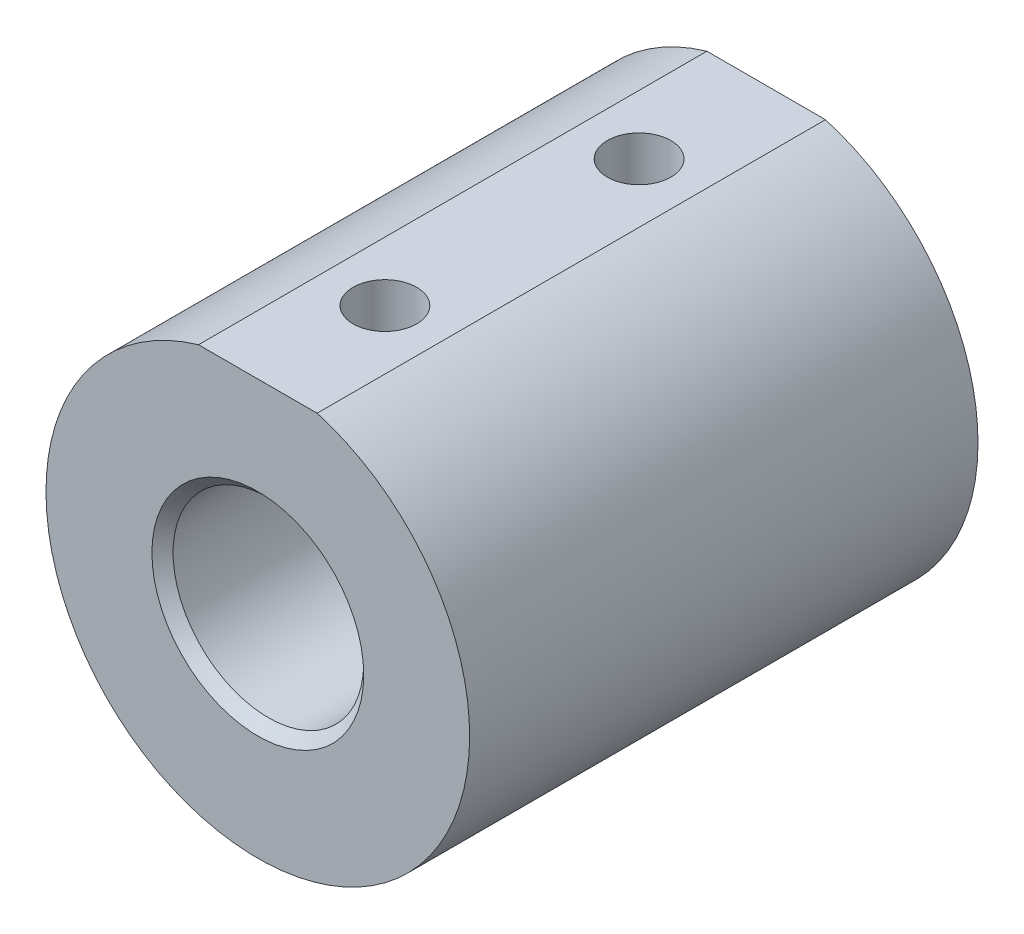
ISO-10303-21;
HEADER;
FILE_DESCRIPTION(('STEP AP214'),'2;1');
FILE_NAME('part.step','',(''),(''),'','','');
FILE_SCHEMA(('AUTOMOTIVE_DESIGN { 1 0 10303 214 1 1 1 1 }'));
ENDSEC;
DATA;
#1=APPLICATION_CONTEXT('core data for automotive mechanical design processes');
#2=APPLICATION_PROTOCOL_DEFINITION('international standard','automotive_design',2000,#1);
#3=PRODUCT_CONTEXT('',#1,'mechanical');
#4=PRODUCT('Part','Part','',(#3));
#5=PRODUCT_RELATED_PRODUCT_CATEGORY('part','',(#4));
#6=PRODUCT_DEFINITION_FORMATION('','',#4);
#7=PRODUCT_DEFINITION_CONTEXT('part definition',#1,'design');
#8=PRODUCT_DEFINITION('design','',#6,#7);
#9=PRODUCT_DEFINITION_SHAPE('','',#8);
#10=(LENGTH_UNIT() NAMED_UNIT(*) SI_UNIT(.MILLI.,.METRE.));
#11=(NAMED_UNIT(*) PLANE_ANGLE_UNIT() SI_UNIT($,.RADIAN.));
#12=(NAMED_UNIT(*) SI_UNIT($,.STERADIAN.) SOLID_ANGLE_UNIT());
#13=UNCERTAINTY_MEASURE_WITH_UNIT(LENGTH_MEASURE(1.E-05),#10,'distance_accuracy_value','');
#14=(GEOMETRIC_REPRESENTATION_CONTEXT(3) GLOBAL_UNCERTAINTY_ASSIGNED_CONTEXT((#13)) GLOBAL_UNIT_ASSIGNED_CONTEXT((#10,
#11,#12)) REPRESENTATION_CONTEXT('',''));
#15=CARTESIAN_POINT('',(0.,0.,0.));
#16=DIRECTION('',(0.,0.,1.));
#17=DIRECTION('',(1.,0.,0.));
#18=AXIS2_PLACEMENT_3D('',#15,#16,#17);
#19=CARTESIAN_POINT('',(0.,30.48,76.2));
#20=DIRECTION('',(0.,1.,0.));
#21=DIRECTION('',(0.,0.,1.));
#22=AXIS2_PLACEMENT_3D('',#19,#20,#21);
#23=PLANE('',#22);
#24=CARTESIAN_POINT('',(0.,30.48,57.15));
#25=DIRECTION('',(0.,1.,0.));
#26=DIRECTION('',(0.,0.,1.));
#27=AXIS2_PLACEMENT_3D('',#24,#25,#26);
#28=CIRCLE('',#27,4.76249999999999);
#29=CARTESIAN_POINT('',(0.,30.48,61.9125));
#30=VERTEX_POINT('',#29);
#31=EDGE_CURVE('E80',#30,#30,#28,.T.);
#32=ORIENTED_EDGE('',*,*,#31,.F.);
#33=EDGE_LOOP('',(#32));
#34=FACE_BOUND('',#33,.T.);
#35=CARTESIAN_POINT('',(0.,30.48,19.05));
#36=DIRECTION('',(0.,1.,0.));
#37=DIRECTION('',(0.,0.,1.));
#38=AXIS2_PLACEMENT_3D('',#35,#36,#37);
#39=CIRCLE('',#38,4.7625);
#40=CARTESIAN_POINT('',(0.,30.48,23.8125));
#41=VERTEX_POINT('',#40);
#42=EDGE_CURVE('E180',#41,#41,#39,.T.);
#43=ORIENTED_EDGE('',*,*,#42,.F.);
#44=EDGE_LOOP('',(#43));
#45=FACE_BOUND('',#44,.T.);
#46=DIRECTION('',(1.,0.,0.));
#47=VECTOR('',#46,1.);
#48=CARTESIAN_POINT('',(0.,30.48,0.));
#49=LINE('',#48,#47);
#50=CARTESIAN_POINT('',(-8.89,30.48,0.));
#51=VERTEX_POINT('',#50);
#52=CARTESIAN_POINT('',(8.89,30.48,0.));
#53=VERTEX_POINT('',#52);
#54=EDGE_CURVE('E72',#51,#53,#49,.T.);
#55=ORIENTED_EDGE('',*,*,#54,.F.);
#56=DIRECTION('',(0.,0.,-1.));
#57=VECTOR('',#56,1.);
#58=CARTESIAN_POINT('',(-8.89,30.48,76.2));
#59=LINE('',#58,#57);
#60=CARTESIAN_POINT('',(-8.89,30.48,76.2));
#61=VERTEX_POINT('',#60);
#62=EDGE_CURVE('E64',#61,#51,#59,.T.);
#63=ORIENTED_EDGE('',*,*,#62,.F.);
#64=DIRECTION('',(1.,0.,0.));
#65=VECTOR('',#64,1.);
#66=CARTESIAN_POINT('',(0.,30.48,76.2));
#67=LINE('',#66,#65);
#68=CARTESIAN_POINT('',(8.89,30.48,76.2));
#69=VERTEX_POINT('',#68);
#70=EDGE_CURVE('E73',#61,#69,#67,.T.);
#71=ORIENTED_EDGE('',*,*,#70,.T.);
#72=DIRECTION('',(0.,0.,-1.));
#73=VECTOR('',#72,1.);
#74=CARTESIAN_POINT('',(8.89,30.48,76.2));
#75=LINE('',#74,#73);
#76=EDGE_CURVE('E70',#69,#53,#75,.T.);
#77=ORIENTED_EDGE('',*,*,#76,.T.);
#78=EDGE_LOOP('',(#55,#63,#71,#77));
#79=FACE_BOUND('',#78,.T.);
#80=ADVANCED_FACE('F39',(#34,#45,#79),#23,.T.);
#81=CARTESIAN_POINT('',(0.,0.,76.2));
#82=DIRECTION('',(0.,0.,-1.));
#83=DIRECTION('',(-1.,0.,0.));
#84=AXIS2_PLACEMENT_3D('',#81,#82,#83);
#85=CYLINDRICAL_SURFACE('',#84,14.2875);
#86=CARTESIAN_POINT('',(0.,0.,1.58749999999998));
#87=DIRECTION('',(0.,0.,1.));
#88=DIRECTION('',(1.,0.,0.));
#89=AXIS2_PLACEMENT_3D('',#86,#87,#88);
#90=CIRCLE('',#89,14.2875);
#91=CARTESIAN_POINT('',(14.2875,0.,1.58749999999998));
#92=VERTEX_POINT('',#91);
#93=EDGE_CURVE('E49',#92,#92,#90,.F.);
#94=ORIENTED_EDGE('',*,*,#93,.T.);
#95=EDGE_LOOP('',(#94));
#96=FACE_BOUND('',#95,.T.);
#97=CARTESIAN_POINT('',(0.,0.,74.6124999999999));
#98=DIRECTION('',(0.,0.,1.));
#99=DIRECTION('',(1.,0.,0.));
#100=AXIS2_PLACEMENT_3D('',#97,#98,#99);
#101=CIRCLE('',#100,14.2875);
#102=CARTESIAN_POINT('',(14.2875,0.,74.6124999999999));
#103=VERTEX_POINT('',#102);
#104=EDGE_CURVE('E92',#103,#103,#101,.T.);
#105=ORIENTED_EDGE('',*,*,#104,.T.);
#106=EDGE_LOOP('',(#105));
#107=FACE_BOUND('',#106,.T.);
#108=CARTESIAN_POINT('',(0.,14.2875,61.9125));
#109=CARTESIAN_POINT('',(0.259858015748032,14.2875007287075,61.9125012083969));
#110=CARTESIAN_POINT('',(0.519708738989856,14.2803452727968,61.8911627325691));
#111=CARTESIAN_POINT('',(1.03175638615754,14.2525056359312,61.806633869258));
#112=CARTESIAN_POINT('',(1.28395251266588,14.2318200505025,61.7434391369433));
#113=CARTESIAN_POINT('',(1.77323491000222,14.1791677890443,61.5776046033835));
#114=CARTESIAN_POINT('',(2.01034567078225,14.1472199781818,61.4750307400377));
#115=CARTESIAN_POINT('',(2.46399813653537,14.0753042272884,61.2336476643574));
#116=CARTESIAN_POINT('',(2.68053577251585,14.0353347055531,61.0948313041751));
#117=CARTESIAN_POINT('',(3.09439472729355,13.950033747848,60.7798546043602));
#118=CARTESIAN_POINT('',(3.29090512267069,13.9045738765872,60.6026637468344));
#119=CARTESIAN_POINT('',(3.6520406989937,13.8141224915467,60.21815892571));
#120=CARTESIAN_POINT('',(3.81665885839365,13.7691310829646,60.0108383461531));
#121=CARTESIAN_POINT('',(4.11396628736011,13.6832974592279,59.5646583888767));
#122=CARTESIAN_POINT('',(4.2456013872774,13.6426117454961,59.3250635645252));
#123=CARTESIAN_POINT('',(4.46636238684293,13.5719489205694,58.8255613501417));
#124=CARTESIAN_POINT('',(4.55550125880551,13.5419685421874,58.5656601870145));
#125=CARTESIAN_POINT('',(4.6856973604364,13.4974633181733,58.04214378262));
#126=CARTESIAN_POINT('',(4.72827404739063,13.4824515609147,57.7789490445636));
#127=CARTESIAN_POINT('',(4.76888709988414,13.4681431470933,57.2487563708398));
#128=CARTESIAN_POINT('',(4.7669372289062,13.4688416343787,56.9817596358994));
#129=CARTESIAN_POINT('',(4.71973229137337,13.485448089363,56.4645017974729));
#130=CARTESIAN_POINT('',(4.67646026140595,13.5006595542244,56.214033480981));
#131=CARTESIAN_POINT('',(4.55107435051982,13.5434383226676,55.7241388390111));
#132=CARTESIAN_POINT('',(4.46895581913248,13.5710071055721,55.4847138393397));
#133=CARTESIAN_POINT('',(4.26690976402751,13.6358905180267,55.0191967801066));
#134=CARTESIAN_POINT('',(4.14639465697257,13.6733549460049,54.7933815287111));
#135=CARTESIAN_POINT('',(3.87138436876448,13.7537456020613,54.3645522993081));
#136=CARTESIAN_POINT('',(3.71687937263242,13.7966734062413,54.1615449329771));
#137=CARTESIAN_POINT('',(3.36875119690038,13.8858940516447,53.7729512637621));
#138=CARTESIAN_POINT('',(3.17350687723877,13.9322455680327,53.5888277924013));
#139=CARTESIAN_POINT('',(2.75434220198211,14.0211304406743,53.2555548425148));
#140=CARTESIAN_POINT('',(2.53041909933455,14.0636634304982,53.1064087182414));
#141=CARTESIAN_POINT('',(2.05715050713295,14.1406772655397,52.8461463701307));
#142=CARTESIAN_POINT('',(1.80757485393284,14.1750740441335,52.7354220974898));
#143=CARTESIAN_POINT('',(1.29191900952345,14.2313295102531,52.5579823840359));
#144=CARTESIAN_POINT('',(1.02584458671297,14.2531925528135,52.4912516557959));
#145=CARTESIAN_POINT('',(0.497127988133329,14.2811957392775,52.4062848905685));
#146=CARTESIAN_POINT('',(0.234836969356345,14.2879763373313,52.3860721588148));
#147=CARTESIAN_POINT('',(-0.289441270685619,14.2869714908411,52.3890843580127));
#148=CARTESIAN_POINT('',(-0.551428535759822,14.2791885049721,52.4123019569042));
#149=CARTESIAN_POINT('',(-1.059750863274,14.2503536771521,52.4999517105925));
#150=CARTESIAN_POINT('',(-1.30631949255093,14.2296927136205,52.5631705563107));
#151=CARTESIAN_POINT('',(-1.78525150273521,14.1775742052821,52.7275112792728));
#152=CARTESIAN_POINT('',(-2.01761306777223,14.1461152837229,52.8286379899653));
#153=CARTESIAN_POINT('',(-2.46834801157295,14.0745653525572,53.0688729316418));
#154=CARTESIAN_POINT('',(-2.68619268077165,14.0342690527443,53.2089102505111));
#155=CARTESIAN_POINT('',(-3.09593375352071,13.949612717762,53.5218996394392));
#156=CARTESIAN_POINT('',(-3.28782220162642,13.905251443656,53.6948617618513));
#157=CARTESIAN_POINT('',(-3.64927756842749,13.8149098850687,54.0780863016689));
#158=CARTESIAN_POINT('',(-3.81743411603297,13.7689476217888,54.2896864432392));
#159=CARTESIAN_POINT('',(-4.11602645006601,13.6826612281605,54.7390870916994));
#160=CARTESIAN_POINT('',(-4.24646192202143,13.6423371448179,54.9768878169948));
#161=CARTESIAN_POINT('',(-4.4653053811079,13.5722864090646,55.4720427353181));
#162=CARTESIAN_POINT('',(-4.55379835443589,13.5425383577656,55.7293561520413));
#163=CARTESIAN_POINT('',(-4.68579835044141,13.4974408885947,56.2564533208352));
#164=CARTESIAN_POINT('',(-4.72932563921812,13.4820849844508,56.5262313977382));
#165=CARTESIAN_POINT('',(-4.76857829529832,13.4682480288827,57.0556886698949));
#166=CARTESIAN_POINT('',(-4.76664460043123,13.4689405622594,57.315174645616));
#167=CARTESIAN_POINT('',(-4.72079142254938,13.4850792253617,57.8299186693163));
#168=CARTESIAN_POINT('',(-4.67687443842149,13.5005244769909,58.0851769680111));
#169=CARTESIAN_POINT('',(-4.54995826002849,13.5438129700205,58.5793960950493));
#170=CARTESIAN_POINT('',(-4.46771718539887,13.5714151683205,58.8185743790839));
#171=CARTESIAN_POINT('',(-4.26710172943078,13.6358184937296,59.2799205255435));
#172=CARTESIAN_POINT('',(-4.14871932773748,13.6726216623566,59.5020845985329));
#173=CARTESIAN_POINT('',(-3.87315404842857,13.7532822418905,59.9336034780079));
#174=CARTESIAN_POINT('',(-3.7145035061663,13.7973773919568,60.1419763402911));
#175=CARTESIAN_POINT('',(-3.36538673093351,13.8866573429899,60.5298977362423));
#176=CARTESIAN_POINT('',(-3.17491150220016,13.9318424489517,60.7094380917145));
#177=CARTESIAN_POINT('',(-2.75863791483476,14.020325203779,61.0416502635272));
#178=CARTESIAN_POINT('',(-2.53175220804244,14.0634806582849,61.1930022061641));
#179=CARTESIAN_POINT('',(-2.05433941464903,14.1411003295957,61.4552544174012));
#180=CARTESIAN_POINT('',(-1.80381839260529,14.1755667676152,61.5661650274537));
#181=CARTESIAN_POINT('',(-1.29775099479463,14.2306126551393,61.7397242747273));
#182=CARTESIAN_POINT('',(-1.04292919593388,14.2517437416226,61.8043077455793));
#183=CARTESIAN_POINT('',(-0.525400981248787,14.2801851364336,61.8906890867248));
#184=CARTESIAN_POINT('',(-0.262696764271141,14.287499263332,61.9124987784023));
#185=CARTESIAN_POINT('',(0.,14.2875,61.9125));
#186=B_SPLINE_CURVE_WITH_KNOTS('',3,(#108,#109,#110,#111,#112,#113,#114,#115,#116,#117,#118,
#119,#120,#121,#122,#123,#124,#125,#126,#127,#128,#129,#130,#131,#132,#133,#134,#135,#136,#137,
#138,#139,#140,#141,#142,#143,#144,#145,#146,#147,#148,#149,#150,#151,#152,#153,#154,#155,#156,
#157,#158,#159,#160,#161,#162,#163,#164,#165,#166,#167,#168,#169,#170,#171,#172,#173,#174,#175,
#176,#177,#178,#179,#180,#181,#182,#183,#184,#185),.UNSPECIFIED.,.T.,.F.,(4,2,2,2,2,2,2,2,2,2,2,
2,2,2,2,2,2,2,2,2,2,2,2,2,2,2,2,2,2,2,2,2,2,2,2,2,2,2,4),(0.,0.778607342448877,1.55729551983657,
2.33468547954468,3.11222887426821,3.91404558896625,4.71603863531863,5.54109182721777,
6.36589300349618,7.16289171345512,7.95964406865399,8.71998636454023,9.48041970705965,
10.2530991513304,11.0260020094019,11.8392561893337,12.6525883267275,13.4739890691656,
14.2951042303443,15.0806268987848,15.8660169645112,16.6286572737797,17.3913948567227,
18.1741952926252,18.9572351117099,19.7758537147631,20.594479142259,21.4114386585672,
22.2280298091829,23.0026685963776,23.7772612791765,24.5371423347722,25.2971921431982,
26.0904069262645,26.8838463048373,27.7082088473389,28.532360439953,29.3196910926202,
30.1068041201337),.UNSPECIFIED.);
#187=CARTESIAN_POINT('',(0.,14.2875,61.9125));
#188=VERTEX_POINT('',#187);
#189=EDGE_CURVE('E83',#188,#188,#186,.T.);
#190=ORIENTED_EDGE('',*,*,#189,.T.);
#191=EDGE_LOOP('',(#190));
#192=FACE_BOUND('',#191,.T.);
#193=CARTESIAN_POINT('',(0.,14.2875,23.8125));
#194=CARTESIAN_POINT('',(0.259858015748025,14.2875007287075,23.8125012083969));
#195=CARTESIAN_POINT('',(0.519708738989849,14.2803452727968,23.7911627325691));
#196=CARTESIAN_POINT('',(1.03175638615753,14.2525056359312,23.706633869258));
#197=CARTESIAN_POINT('',(1.28395251266587,14.2318200505025,23.6434391369433));
#198=CARTESIAN_POINT('',(1.77323491000221,14.1791677890443,23.4776046033835));
#199=CARTESIAN_POINT('',(2.01034567078224,14.1472199781818,23.3750307400377));
#200=CARTESIAN_POINT('',(2.46399813653536,14.0753042272884,23.1336476643574));
#201=CARTESIAN_POINT('',(2.68053577251584,14.0353347055531,22.9948313041751));
#202=CARTESIAN_POINT('',(3.09439472729354,13.950033747848,22.6798546043602));
#203=CARTESIAN_POINT('',(3.29090512267068,13.9045738765872,22.5026637468344));
#204=CARTESIAN_POINT('',(3.6520406989937,13.8141224915467,22.11815892571));
#205=CARTESIAN_POINT('',(3.81665885839364,13.7691310829646,21.9108383461531));
#206=CARTESIAN_POINT('',(4.11396628736011,13.6832974592279,21.4646583888767));
#207=CARTESIAN_POINT('',(4.24560138727739,13.6426117454961,21.2250635645252));
#208=CARTESIAN_POINT('',(4.46636238684293,13.5719489205694,20.7255613501417));
#209=CARTESIAN_POINT('',(4.55550125880551,13.5419685421874,20.4656601870145));
#210=CARTESIAN_POINT('',(4.68569736043639,13.4974633181733,19.9421437826199));
#211=CARTESIAN_POINT('',(4.72827404739062,13.4824515609147,19.6789490445636));
#212=CARTESIAN_POINT('',(4.76888709988413,13.4681431470933,19.1487563708398));
#213=CARTESIAN_POINT('',(4.76693722890619,13.4688416343787,18.8817596358994));
#214=CARTESIAN_POINT('',(4.71973229137337,13.485448089363,18.3645017974729));
#215=CARTESIAN_POINT('',(4.67646026140595,13.5006595542244,18.114033480981));
#216=CARTESIAN_POINT('',(4.55107435051981,13.5434383226676,17.6241388390111));
#217=CARTESIAN_POINT('',(4.46895581913248,13.5710071055721,17.3847138393397));
#218=CARTESIAN_POINT('',(4.2669097640275,13.6358905180267,16.9191967801066));
#219=CARTESIAN_POINT('',(4.14639465697257,13.6733549460049,16.6933815287111));
#220=CARTESIAN_POINT('',(3.87138436876447,13.7537456020613,16.2645522993081));
#221=CARTESIAN_POINT('',(3.71687937263242,13.7966734062413,16.0615449329771));
#222=CARTESIAN_POINT('',(3.36875119690038,13.8858940516447,15.6729512637621));
#223=CARTESIAN_POINT('',(3.17350687723876,13.9322455680327,15.4888277924013));
#224=CARTESIAN_POINT('',(2.7543422019821,14.0211304406743,15.1555548425148));
#225=CARTESIAN_POINT('',(2.53041909933454,14.0636634304982,15.0064087182414));
#226=CARTESIAN_POINT('',(2.05715050713294,14.1406772655397,14.7461463701307));
#227=CARTESIAN_POINT('',(1.80757485393283,14.1750740441335,14.6354220974898));
#228=CARTESIAN_POINT('',(1.29191900952345,14.2313295102531,14.4579823840359));
#229=CARTESIAN_POINT('',(1.02584458671296,14.2531925528135,14.3912516557959));
#230=CARTESIAN_POINT('',(0.49712798813332,14.2811957392775,14.3062848905685));
#231=CARTESIAN_POINT('',(0.234836969356336,14.2879763373313,14.2860721588148));
#232=CARTESIAN_POINT('',(-0.289441270685627,14.2869714908411,14.2890843580127));
#233=CARTESIAN_POINT('',(-0.551428535759831,14.2791885049721,14.3123019569042));
#234=CARTESIAN_POINT('',(-1.05975086327401,14.2503536771521,14.3999517105925));
#235=CARTESIAN_POINT('',(-1.30631949255094,14.2296927136205,14.4631705563107));
#236=CARTESIAN_POINT('',(-1.78525150273521,14.1775742052821,14.6275112792728));
#237=CARTESIAN_POINT('',(-2.01761306777223,14.1461152837229,14.7286379899653));
#238=CARTESIAN_POINT('',(-2.46834801157296,14.0745653525572,14.9688729316417));
#239=CARTESIAN_POINT('',(-2.68619268077166,14.0342690527443,15.1089102505111));
#240=CARTESIAN_POINT('',(-3.09593375352072,13.949612717762,15.4218996394392));
#241=CARTESIAN_POINT('',(-3.28782220162643,13.905251443656,15.5948617618513));
#242=CARTESIAN_POINT('',(-3.6492775684275,13.8149098850687,15.9780863016689));
#243=CARTESIAN_POINT('',(-3.81743411603298,13.7689476217888,16.1896864432392));
#244=CARTESIAN_POINT('',(-4.11602645006602,13.6826612281605,16.6390870916994));
#245=CARTESIAN_POINT('',(-4.24646192202144,13.6423371448179,16.8768878169948));
#246=CARTESIAN_POINT('',(-4.46530538110791,13.5722864090646,17.3720427353181));
#247=CARTESIAN_POINT('',(-4.5537983544359,13.5425383577656,17.6293561520413));
#248=CARTESIAN_POINT('',(-4.68579835044142,13.4974408885947,18.1564533208352));
#249=CARTESIAN_POINT('',(-4.72932563921813,13.4820849844508,18.4262313977382));
#250=CARTESIAN_POINT('',(-4.76857829529833,13.4682480288827,18.9556886698949));
#251=CARTESIAN_POINT('',(-4.76664460043124,13.4689405622594,19.215174645616));
#252=CARTESIAN_POINT('',(-4.72079142254939,13.4850792253617,19.7299186693163));
#253=CARTESIAN_POINT('',(-4.6768744384215,13.5005244769909,19.9851769680111));
#254=CARTESIAN_POINT('',(-4.5499582600285,13.5438129700205,20.4793960950493));
#255=CARTESIAN_POINT('',(-4.46771718539888,13.5714151683205,20.7185743790839));
#256=CARTESIAN_POINT('',(-4.26710172943078,13.6358184937296,21.1799205255435));
#257=CARTESIAN_POINT('',(-4.14871932773749,13.6726216623566,21.4020845985329));
#258=CARTESIAN_POINT('',(-3.87315404842857,13.7532822418905,21.8336034780079));
#259=CARTESIAN_POINT('',(-3.7145035061663,13.7973773919568,22.0419763402911));
#260=CARTESIAN_POINT('',(-3.36538673093352,13.8866573429899,22.4298977362423));
#261=CARTESIAN_POINT('',(-3.17491150220017,13.9318424489517,22.6094380917145));
#262=CARTESIAN_POINT('',(-2.75863791483476,14.020325203779,22.9416502635272));
#263=CARTESIAN_POINT('',(-2.53175220804244,14.0634806582849,23.0930022061641));
#264=CARTESIAN_POINT('',(-2.05433941464904,14.1411003295957,23.3552544174012));
#265=CARTESIAN_POINT('',(-1.8038183926053,14.1755667676152,23.4661650274537));
#266=CARTESIAN_POINT('',(-1.29775099479464,14.2306126551393,23.6397242747273));
#267=CARTESIAN_POINT('',(-1.04292919593389,14.2517437416226,23.7043077455793));
#268=CARTESIAN_POINT('',(-0.525400981248793,14.2801851364336,23.7906890867248));
#269=CARTESIAN_POINT('',(-0.262696764271147,14.287499263332,23.8124987784023));
#270=CARTESIAN_POINT('',(0.,14.2875,23.8125));
#271=B_SPLINE_CURVE_WITH_KNOTS('',3,(#193,#194,#195,#196,#197,#198,#199,#200,#201,#202,#203,
#204,#205,#206,#207,#208,#209,#210,#211,#212,#213,#214,#215,#216,#217,#218,#219,#220,#221,#222,
#223,#224,#225,#226,#227,#228,#229,#230,#231,#232,#233,#234,#235,#236,#237,#238,#239,#240,#241,
#242,#243,#244,#245,#246,#247,#248,#249,#250,#251,#252,#253,#254,#255,#256,#257,#258,#259,#260,
#261,#262,#263,#264,#265,#266,#267,#268,#269,#270),.UNSPECIFIED.,.T.,.F.,(4,2,2,2,2,2,2,2,2,2,2,
2,2,2,2,2,2,2,2,2,2,2,2,2,2,2,2,2,2,2,2,2,2,2,2,2,2,2,4),(0.,0.778607342448877,1.55729551983657,
2.33468547954468,3.11222887426821,3.91404558896625,4.71603863531862,5.54109182721778,
6.36589300349619,7.16289171345513,7.95964406865398,8.71998636454023,9.48041970705964,
10.2530991513304,11.0260020094019,11.8392561893337,12.6525883267275,13.4739890691656,
14.2951042303444,15.0806268987848,15.8660169645112,16.6286572737797,17.3913948567228,
18.1741952926253,18.9572351117099,19.7758537147631,20.594479142259,21.4114386585672,
22.2280298091829,23.0026685963776,23.7772612791765,24.5371423347722,25.2971921431982,
26.0904069262645,26.8838463048373,27.708208847339,28.532360439953,29.3196910926202,
30.1068041201337),.UNSPECIFIED.);
#272=CARTESIAN_POINT('',(0.,14.2875,23.8125));
#273=VERTEX_POINT('',#272);
#274=EDGE_CURVE('E179',#273,#273,#271,.T.);
#275=ORIENTED_EDGE('',*,*,#274,.T.);
#276=EDGE_LOOP('',(#275));
#277=FACE_BOUND('',#276,.T.);
#278=ADVANCED_FACE('F97',(#96,#107,#192,#277),#85,.F.);
#279=CARTESIAN_POINT('',(0.,0.,76.2));
#280=DIRECTION('',(0.,0.,-1.));
#281=DIRECTION('',(-1.,0.,0.));
#282=AXIS2_PLACEMENT_3D('',#279,#280,#281);
#283=CYLINDRICAL_SURFACE('',#282,31.75);
#284=CARTESIAN_POINT('',(0.,0.,0.));
#285=DIRECTION('',(0.,0.,1.));
#286=DIRECTION('',(1.,0.,0.));
#287=AXIS2_PLACEMENT_3D('',#284,#285,#286);
#288=CIRCLE('',#287,31.75);
#289=EDGE_CURVE('E75',#51,#53,#288,.T.);
#290=ORIENTED_EDGE('',*,*,#289,.T.);
#291=ORIENTED_EDGE('',*,*,#76,.F.);
#292=CARTESIAN_POINT('',(0.,0.,76.2));
#293=DIRECTION('',(0.,0.,1.));
#294=DIRECTION('',(1.,0.,0.));
#295=AXIS2_PLACEMENT_3D('',#292,#293,#294);
#296=CIRCLE('',#295,31.75);
#297=EDGE_CURVE('E56',#61,#69,#296,.T.);
#298=ORIENTED_EDGE('',*,*,#297,.F.);
#299=ORIENTED_EDGE('',*,*,#62,.T.);
#300=EDGE_LOOP('',(#290,#291,#298,#299));
#301=FACE_BOUND('',#300,.T.);
#302=ADVANCED_FACE('F76',(#301),#283,.T.);
#303=CARTESIAN_POINT('',(0.,0.,76.2));
#304=DIRECTION('',(0.,0.,1.));
#305=DIRECTION('',(1.,0.,0.));
#306=AXIS2_PLACEMENT_3D('',#303,#304,#305);
#307=PLANE('',#306);
#308=CARTESIAN_POINT('',(0.,0.,76.2));
#309=DIRECTION('',(0.,0.,1.));
#310=DIRECTION('',(1.,0.,0.));
#311=AXIS2_PLACEMENT_3D('',#308,#309,#310);
#312=CIRCLE('',#311,15.8750000000001);
#313=CARTESIAN_POINT('',(15.8750000000001,0.,76.2));
#314=VERTEX_POINT('',#313);
#315=EDGE_CURVE('E11',#314,#314,#312,.F.);
#316=ORIENTED_EDGE('',*,*,#315,.T.);
#317=EDGE_LOOP('',(#316));
#318=FACE_BOUND('',#317,.T.);
#319=ORIENTED_EDGE('',*,*,#70,.F.);
#320=ORIENTED_EDGE('',*,*,#297,.T.);
#321=EDGE_LOOP('',(#319,#320));
#322=FACE_BOUND('',#321,.T.);
#323=ADVANCED_FACE('F108',(#318,#322),#307,.T.);
#324=CARTESIAN_POINT('',(0.,0.,0.));
#325=DIRECTION('',(0.,0.,1.));
#326=DIRECTION('',(1.,0.,0.));
#327=AXIS2_PLACEMENT_3D('',#324,#325,#326);
#328=PLANE('',#327);
#329=CARTESIAN_POINT('',(0.,0.,0.));
#330=DIRECTION('',(0.,0.,1.));
#331=DIRECTION('',(1.,0.,0.));
#332=AXIS2_PLACEMENT_3D('',#329,#330,#331);
#333=CIRCLE('',#332,15.875);
#334=CARTESIAN_POINT('',(15.875,0.,0.));
#335=VERTEX_POINT('',#334);
#336=EDGE_CURVE('E89',#335,#335,#333,.T.);
#337=ORIENTED_EDGE('',*,*,#336,.T.);
#338=EDGE_LOOP('',(#337));
#339=FACE_BOUND('',#338,.T.);
#340=ORIENTED_EDGE('',*,*,#54,.T.);
#341=ORIENTED_EDGE('',*,*,#289,.F.);
#342=EDGE_LOOP('',(#340,#341));
#343=FACE_BOUND('',#342,.T.);
#344=ADVANCED_FACE('F79',(#339,#343),#328,.F.);
#345=CARTESIAN_POINT('',(0.,-31.751,19.05));
#346=DIRECTION('',(0.,1.,0.));
#347=DIRECTION('',(0.,0.,1.));
#348=AXIS2_PLACEMENT_3D('',#345,#346,#347);
#349=CYLINDRICAL_SURFACE('',#348,4.7625);
#350=ORIENTED_EDGE('',*,*,#274,.F.);
#351=EDGE_LOOP('',(#350));
#352=FACE_BOUND('',#351,.T.);
#353=ORIENTED_EDGE('',*,*,#42,.T.);
#354=EDGE_LOOP('',(#353));
#355=FACE_BOUND('',#354,.T.);
#356=ADVANCED_FACE('F107',(#352,#355),#349,.F.);
#357=CARTESIAN_POINT('',(0.,-31.751,57.15));
#358=DIRECTION('',(0.,1.,0.));
#359=DIRECTION('',(0.,0.,1.));
#360=AXIS2_PLACEMENT_3D('',#357,#358,#359);
#361=CYLINDRICAL_SURFACE('',#360,4.76249999999999);
#362=ORIENTED_EDGE('',*,*,#189,.F.);
#363=EDGE_LOOP('',(#362));
#364=FACE_BOUND('',#363,.T.);
#365=ORIENTED_EDGE('',*,*,#31,.T.);
#366=EDGE_LOOP('',(#365));
#367=FACE_BOUND('',#366,.T.);
#368=ADVANCED_FACE('F103',(#364,#367),#361,.F.);
#369=CARTESIAN_POINT('',(0.,0.,0.));
#370=DIRECTION('',(0.,0.,-1.));
#371=DIRECTION('',(-1.,0.,0.));
#372=AXIS2_PLACEMENT_3D('',#369,#370,#371);
#373=CONICAL_SURFACE('',#372,15.875,0.785398163397446);
#374=ORIENTED_EDGE('',*,*,#93,.F.);
#375=EDGE_LOOP('',(#374));
#376=FACE_BOUND('',#375,.T.);
#377=ORIENTED_EDGE('',*,*,#336,.F.);
#378=EDGE_LOOP('',(#377));
#379=FACE_BOUND('',#378,.T.);
#380=ADVANCED_FACE('F100',(#376,#379),#373,.F.);
#381=CARTESIAN_POINT('',(0.,0.,74.6124999999999));
#382=DIRECTION('',(0.,0.,1.));
#383=DIRECTION('',(1.,0.,0.));
#384=AXIS2_PLACEMENT_3D('',#381,#382,#383);
#385=CONICAL_SURFACE('',#384,14.2875,0.785398163397445);
#386=ORIENTED_EDGE('',*,*,#315,.F.);
#387=EDGE_LOOP('',(#386));
#388=FACE_BOUND('',#387,.T.);
#389=ORIENTED_EDGE('',*,*,#104,.F.);
#390=EDGE_LOOP('',(#389));
#391=FACE_BOUND('',#390,.T.);
#392=ADVANCED_FACE('F42',(#388,#391),#385,.F.);
#393=CLOSED_SHELL('',(#80,#278,#302,#323,#344,#356,#368,#380,#392));
#394=MANIFOLD_SOLID_BREP('B2',#393);
#395=ADVANCED_BREP_SHAPE_REPRESENTATION('',(#18,#394),#14);
#396=SHAPE_DEFINITION_REPRESENTATION(#9,#395);
ENDSEC;
END-ISO-10303-21;
